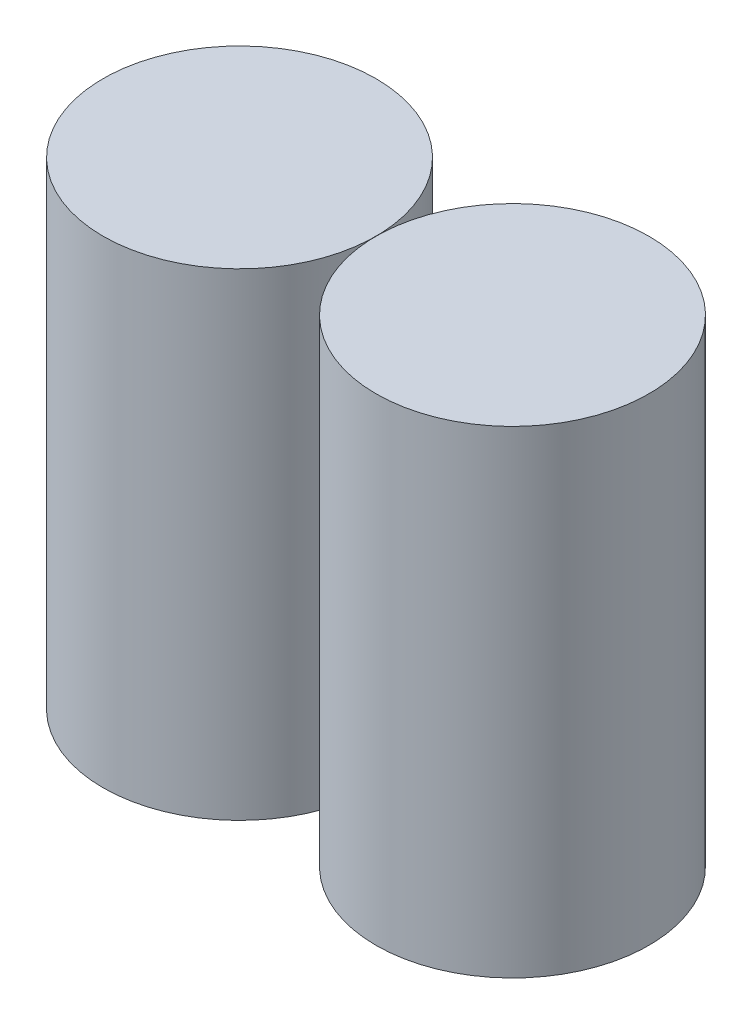
ISO-10303-21;
HEADER;
FILE_DESCRIPTION(('STEP AP214'),'2;1');
FILE_NAME('part.step','',(''),(''),'','','');
FILE_SCHEMA(('AUTOMOTIVE_DESIGN { 1 0 10303 214 1 1 1 1 }'));
ENDSEC;
DATA;
#1=APPLICATION_CONTEXT('core data for automotive mechanical design processes');
#2=APPLICATION_PROTOCOL_DEFINITION('international standard','automotive_design',2000,#1);
#3=PRODUCT_CONTEXT('',#1,'mechanical');
#4=PRODUCT('Part','Part','',(#3));
#5=PRODUCT_RELATED_PRODUCT_CATEGORY('part','',(#4));
#6=PRODUCT_DEFINITION_FORMATION('','',#4);
#7=PRODUCT_DEFINITION_CONTEXT('part definition',#1,'design');
#8=PRODUCT_DEFINITION('design','',#6,#7);
#9=PRODUCT_DEFINITION_SHAPE('','',#8);
#10=(LENGTH_UNIT() NAMED_UNIT(*) SI_UNIT(.MILLI.,.METRE.));
#11=(NAMED_UNIT(*) PLANE_ANGLE_UNIT() SI_UNIT($,.RADIAN.));
#12=(NAMED_UNIT(*) SI_UNIT($,.STERADIAN.) SOLID_ANGLE_UNIT());
#13=UNCERTAINTY_MEASURE_WITH_UNIT(LENGTH_MEASURE(1.E-05),#10,'distance_accuracy_value','');
#14=(GEOMETRIC_REPRESENTATION_CONTEXT(3) GLOBAL_UNCERTAINTY_ASSIGNED_CONTEXT((#13)) GLOBAL_UNIT_ASSIGNED_CONTEXT((#10,
#11,#12)) REPRESENTATION_CONTEXT('',''));
#15=CARTESIAN_POINT('',(0.,0.,0.));
#16=DIRECTION('',(0.,0.,1.));
#17=DIRECTION('',(1.,0.,0.));
#18=AXIS2_PLACEMENT_3D('',#15,#16,#17);
#19=CARTESIAN_POINT('',(-24.,42.,0.));
#20=DIRECTION('',(0.,-1.,0.));
#21=DIRECTION('',(0.,0.,-1.));
#22=AXIS2_PLACEMENT_3D('',#19,#20,#21);
#23=CYLINDRICAL_SURFACE('',#22,12.);
#24=CARTESIAN_POINT('',(-24.,42.,0.));
#25=DIRECTION('',(0.,1.,0.));
#26=DIRECTION('',(0.,0.,1.));
#27=AXIS2_PLACEMENT_3D('',#24,#25,#26);
#28=CIRCLE('',#27,12.);
#29=CARTESIAN_POINT('',(-24.,42.,12.));
#30=VERTEX_POINT('',#29);
#31=EDGE_CURVE('E12',#30,#30,#28,.T.);
#32=ORIENTED_EDGE('',*,*,#31,.F.);
#33=EDGE_LOOP('',(#32));
#34=FACE_BOUND('',#33,.T.);
#35=CARTESIAN_POINT('',(-24.,0.,0.));
#36=DIRECTION('',(0.,1.,0.));
#37=DIRECTION('',(0.,0.,1.));
#38=AXIS2_PLACEMENT_3D('',#35,#36,#37);
#39=CIRCLE('',#38,12.);
#40=CARTESIAN_POINT('',(-24.,0.,12.));
#41=VERTEX_POINT('',#40);
#42=EDGE_CURVE('E58',#41,#41,#39,.T.);
#43=ORIENTED_EDGE('',*,*,#42,.T.);
#44=EDGE_LOOP('',(#43));
#45=FACE_BOUND('',#44,.T.);
#46=ADVANCED_FACE('F55',(#34,#45),#23,.T.);
#47=CARTESIAN_POINT('',(0.,42.,0.));
#48=DIRECTION('',(0.,1.,0.));
#49=DIRECTION('',(0.,0.,1.));
#50=AXIS2_PLACEMENT_3D('',#47,#48,#49);
#51=PLANE('',#50);
#52=ORIENTED_EDGE('',*,*,#31,.T.);
#53=EDGE_LOOP('',(#52));
#54=FACE_BOUND('',#53,.T.);
#55=ADVANCED_FACE('F70',(#54),#51,.T.);
#56=CARTESIAN_POINT('',(0.,0.,0.));
#57=DIRECTION('',(0.,1.,0.));
#58=DIRECTION('',(0.,0.,1.));
#59=AXIS2_PLACEMENT_3D('',#56,#57,#58);
#60=PLANE('',#59);
#61=ORIENTED_EDGE('',*,*,#42,.F.);
#62=EDGE_LOOP('',(#61));
#63=FACE_BOUND('',#62,.T.);
#64=ADVANCED_FACE('F68',(#63),#60,.F.);
#65=CLOSED_SHELL('',(#46,#55,#64));
#66=MANIFOLD_SOLID_BREP('B2',#65);
#67=CARTESIAN_POINT('',(0.,42.,0.));
#68=DIRECTION('',(0.,-1.,0.));
#69=DIRECTION('',(0.,0.,-1.));
#70=AXIS2_PLACEMENT_3D('',#67,#68,#69);
#71=CYLINDRICAL_SURFACE('',#70,12.);
#72=CARTESIAN_POINT('',(0.,42.,0.));
#73=DIRECTION('',(0.,1.,0.));
#74=DIRECTION('',(0.,0.,1.));
#75=AXIS2_PLACEMENT_3D('',#72,#73,#74);
#76=CIRCLE('',#75,12.);
#77=CARTESIAN_POINT('',(0.,42.,12.));
#78=VERTEX_POINT('',#77);
#79=EDGE_CURVE('E54',#78,#78,#76,.T.);
#80=ORIENTED_EDGE('',*,*,#79,.F.);
#81=EDGE_LOOP('',(#80));
#82=FACE_BOUND('',#81,.T.);
#83=CARTESIAN_POINT('',(0.,0.,0.));
#84=DIRECTION('',(0.,1.,0.));
#85=DIRECTION('',(0.,0.,1.));
#86=AXIS2_PLACEMENT_3D('',#83,#84,#85);
#87=CIRCLE('',#86,12.);
#88=CARTESIAN_POINT('',(0.,0.,12.));
#89=VERTEX_POINT('',#88);
#90=EDGE_CURVE('E105',#89,#89,#87,.T.);
#91=ORIENTED_EDGE('',*,*,#90,.T.);
#92=EDGE_LOOP('',(#91));
#93=FACE_BOUND('',#92,.T.);
#94=ADVANCED_FACE('F102',(#82,#93),#71,.T.);
#95=CARTESIAN_POINT('',(0.,42.,0.));
#96=DIRECTION('',(0.,1.,0.));
#97=DIRECTION('',(0.,0.,1.));
#98=AXIS2_PLACEMENT_3D('',#95,#96,#97);
#99=PLANE('',#98);
#100=ORIENTED_EDGE('',*,*,#79,.T.);
#101=EDGE_LOOP('',(#100));
#102=FACE_BOUND('',#101,.T.);
#103=ADVANCED_FACE('F119',(#102),#99,.T.);
#104=CARTESIAN_POINT('',(0.,0.,0.));
#105=DIRECTION('',(0.,1.,0.));
#106=DIRECTION('',(0.,0.,1.));
#107=AXIS2_PLACEMENT_3D('',#104,#105,#106);
#108=PLANE('',#107);
#109=ORIENTED_EDGE('',*,*,#90,.F.);
#110=EDGE_LOOP('',(#109));
#111=FACE_BOUND('',#110,.T.);
#112=ADVANCED_FACE('F117',(#111),#108,.F.);
#113=CLOSED_SHELL('',(#94,#103,#112));
#114=MANIFOLD_SOLID_BREP('B7',#113);
#115=ADVANCED_BREP_SHAPE_REPRESENTATION('',(#18,#66,#114),#14);
#116=SHAPE_DEFINITION_REPRESENTATION(#9,#115);
ENDSEC;
END-ISO-10303-21;
